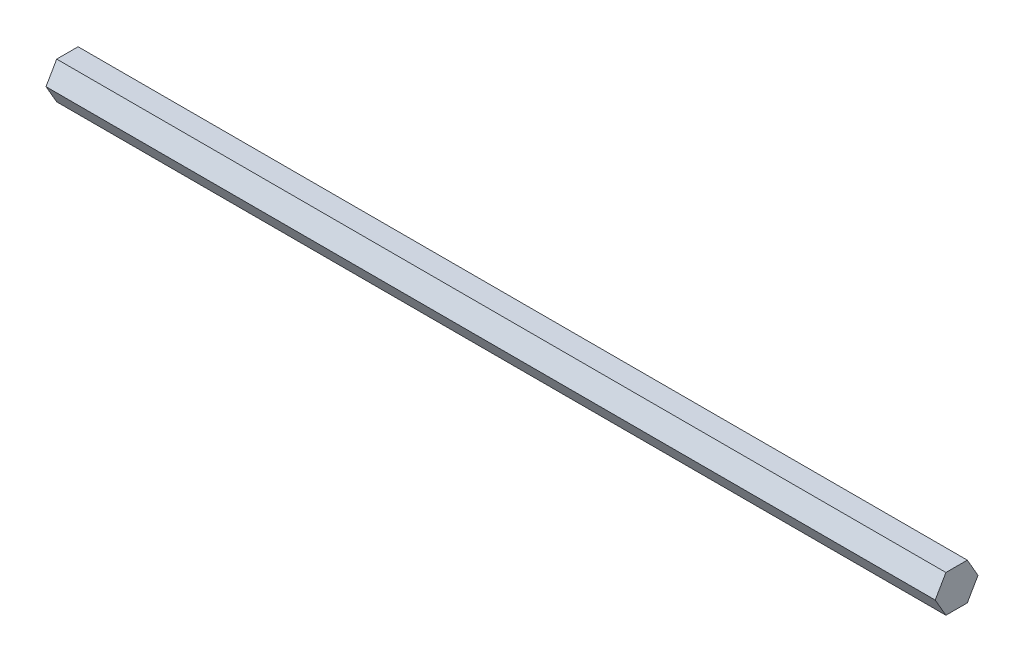
ISO-10303-21;
HEADER;
FILE_DESCRIPTION(('STEP AP214'),'2;1');
FILE_NAME('part.step','',(''),(''),'','','');
FILE_SCHEMA(('AUTOMOTIVE_DESIGN { 1 0 10303 214 1 1 1 1 }'));
ENDSEC;
DATA;
#1=APPLICATION_CONTEXT('core data for automotive mechanical design processes');
#2=APPLICATION_PROTOCOL_DEFINITION('international standard','automotive_design',2000,#1);
#3=PRODUCT_CONTEXT('',#1,'mechanical');
#4=PRODUCT('Part','Part','',(#3));
#5=PRODUCT_RELATED_PRODUCT_CATEGORY('part','',(#4));
#6=PRODUCT_DEFINITION_FORMATION('','',#4);
#7=PRODUCT_DEFINITION_CONTEXT('part definition',#1,'design');
#8=PRODUCT_DEFINITION('design','',#6,#7);
#9=PRODUCT_DEFINITION_SHAPE('','',#8);
#10=(LENGTH_UNIT() NAMED_UNIT(*) SI_UNIT(.MILLI.,.METRE.));
#11=(NAMED_UNIT(*) PLANE_ANGLE_UNIT() SI_UNIT($,.RADIAN.));
#12=(NAMED_UNIT(*) SI_UNIT($,.STERADIAN.) SOLID_ANGLE_UNIT());
#13=UNCERTAINTY_MEASURE_WITH_UNIT(LENGTH_MEASURE(1.E-05),#10,'distance_accuracy_value','');
#14=(GEOMETRIC_REPRESENTATION_CONTEXT(3) GLOBAL_UNCERTAINTY_ASSIGNED_CONTEXT((#13)) GLOBAL_UNIT_ASSIGNED_CONTEXT((#10,
#11,#12)) REPRESENTATION_CONTEXT('',''));
#15=CARTESIAN_POINT('',(0.,0.,0.));
#16=DIRECTION('',(0.,0.,1.));
#17=DIRECTION('',(1.,0.,0.));
#18=AXIS2_PLACEMENT_3D('',#15,#16,#17);
#19=CARTESIAN_POINT('',(0.,0.,0.));
#20=DIRECTION('',(1.,0.,0.));
#21=DIRECTION('',(0.,1.,0.));
#22=AXIS2_PLACEMENT_3D('',#19,#20,#21);
#23=PLANE('',#22);
#24=DIRECTION('',(0.,0.,1.));
#25=VECTOR('',#24,1.);
#26=CARTESIAN_POINT('',(0.,6.35,-3.66617420935413));
#27=LINE('',#26,#25);
#28=CARTESIAN_POINT('',(0.,6.35,-3.66617420935413));
#29=VERTEX_POINT('',#28);
#30=CARTESIAN_POINT('',(0.,6.35,3.66617420935412));
#31=VERTEX_POINT('',#30);
#32=EDGE_CURVE('E184',#29,#31,#27,.T.);
#33=ORIENTED_EDGE('',*,*,#32,.F.);
#34=DIRECTION('',(0.,0.866025403784439,0.5));
#35=VECTOR('',#34,1.);
#36=CARTESIAN_POINT('',(0.,0.,-7.33234841870825));
#37=LINE('',#36,#35);
#38=CARTESIAN_POINT('',(0.,0.,-7.33234841870825));
#39=VERTEX_POINT('',#38);
#40=EDGE_CURVE('E27',#39,#29,#37,.T.);
#41=ORIENTED_EDGE('',*,*,#40,.F.);
#42=DIRECTION('',(0.,0.866025403784439,-0.5));
#43=VECTOR('',#42,1.);
#44=CARTESIAN_POINT('',(0.,-6.35,-3.66617420935413));
#45=LINE('',#44,#43);
#46=CARTESIAN_POINT('',(0.,-6.35,-3.66617420935413));
#47=VERTEX_POINT('',#46);
#48=EDGE_CURVE('E92',#47,#39,#45,.T.);
#49=ORIENTED_EDGE('',*,*,#48,.F.);
#50=DIRECTION('',(0.,0.,-1.));
#51=VECTOR('',#50,1.);
#52=CARTESIAN_POINT('',(0.,-6.35,3.66617420935412));
#53=LINE('',#52,#51);
#54=CARTESIAN_POINT('',(0.,-6.35,3.66617420935412));
#55=VERTEX_POINT('',#54);
#56=EDGE_CURVE('E98',#55,#47,#53,.T.);
#57=ORIENTED_EDGE('',*,*,#56,.F.);
#58=DIRECTION('',(0.,-0.866025403784439,-0.5));
#59=VECTOR('',#58,1.);
#60=CARTESIAN_POINT('',(0.,0.,7.33234841870825));
#61=LINE('',#60,#59);
#62=CARTESIAN_POINT('',(0.,0.,7.33234841870825));
#63=VERTEX_POINT('',#62);
#64=EDGE_CURVE('E117',#63,#55,#61,.T.);
#65=ORIENTED_EDGE('',*,*,#64,.F.);
#66=DIRECTION('',(0.,-0.866025403784438,0.5));
#67=VECTOR('',#66,1.);
#68=CARTESIAN_POINT('',(0.,6.35,3.66617420935412));
#69=LINE('',#68,#67);
#70=EDGE_CURVE('E152',#31,#63,#69,.T.);
#71=ORIENTED_EDGE('',*,*,#70,.F.);
#72=EDGE_LOOP('',(#33,#41,#49,#57,#65,#71));
#73=FACE_BOUND('',#72,.T.);
#74=ADVANCED_FACE('F17',(#73),#23,.F.);
#75=CARTESIAN_POINT('',(304.8,0.,0.));
#76=DIRECTION('',(1.,0.,0.));
#77=DIRECTION('',(0.,1.,0.));
#78=AXIS2_PLACEMENT_3D('',#75,#76,#77);
#79=PLANE('',#78);
#80=DIRECTION('',(0.,0.,1.));
#81=VECTOR('',#80,1.);
#82=CARTESIAN_POINT('',(304.8,6.35,-3.66617420935413));
#83=LINE('',#82,#81);
#84=CARTESIAN_POINT('',(304.8,6.35,-3.66617420935413));
#85=VERTEX_POINT('',#84);
#86=CARTESIAN_POINT('',(304.8,6.35,3.66617420935412));
#87=VERTEX_POINT('',#86);
#88=EDGE_CURVE('E166',#85,#87,#83,.T.);
#89=ORIENTED_EDGE('',*,*,#88,.T.);
#90=DIRECTION('',(0.,-0.866025403784438,0.5));
#91=VECTOR('',#90,1.);
#92=CARTESIAN_POINT('',(304.8,6.35,3.66617420935412));
#93=LINE('',#92,#91);
#94=CARTESIAN_POINT('',(304.8,0.,7.33234841870825));
#95=VERTEX_POINT('',#94);
#96=EDGE_CURVE('E140',#87,#95,#93,.T.);
#97=ORIENTED_EDGE('',*,*,#96,.T.);
#98=DIRECTION('',(0.,-0.866025403784439,-0.5));
#99=VECTOR('',#98,1.);
#100=CARTESIAN_POINT('',(304.8,0.,7.33234841870825));
#101=LINE('',#100,#99);
#102=CARTESIAN_POINT('',(304.8,-6.35,3.66617420935412));
#103=VERTEX_POINT('',#102);
#104=EDGE_CURVE('E89',#95,#103,#101,.T.);
#105=ORIENTED_EDGE('',*,*,#104,.T.);
#106=DIRECTION('',(0.,0.,-1.));
#107=VECTOR('',#106,1.);
#108=CARTESIAN_POINT('',(304.8,-6.35,3.66617420935412));
#109=LINE('',#108,#107);
#110=CARTESIAN_POINT('',(304.8,-6.35,-3.66617420935413));
#111=VERTEX_POINT('',#110);
#112=EDGE_CURVE('E88',#103,#111,#109,.T.);
#113=ORIENTED_EDGE('',*,*,#112,.T.);
#114=DIRECTION('',(0.,0.866025403784439,-0.5));
#115=VECTOR('',#114,1.);
#116=CARTESIAN_POINT('',(304.8,-6.35,-3.66617420935413));
#117=LINE('',#116,#115);
#118=CARTESIAN_POINT('',(304.8,0.,-7.33234841870825));
#119=VERTEX_POINT('',#118);
#120=EDGE_CURVE('E72',#111,#119,#117,.T.);
#121=ORIENTED_EDGE('',*,*,#120,.T.);
#122=DIRECTION('',(0.,0.866025403784439,0.5));
#123=VECTOR('',#122,1.);
#124=CARTESIAN_POINT('',(304.8,0.,-7.33234841870825));
#125=LINE('',#124,#123);
#126=EDGE_CURVE('E11',#119,#85,#125,.T.);
#127=ORIENTED_EDGE('',*,*,#126,.T.);
#128=EDGE_LOOP('',(#89,#97,#105,#113,#121,#127));
#129=FACE_BOUND('',#128,.T.);
#130=ADVANCED_FACE('F86',(#129),#79,.T.);
#131=CARTESIAN_POINT('',(304.8,0.,-7.33234841870825));
#132=DIRECTION('',(0.,-0.5,0.866025403784439));
#133=DIRECTION('',(-1.,0.,0.));
#134=AXIS2_PLACEMENT_3D('',#131,#132,#133);
#135=PLANE('',#134);
#136=ORIENTED_EDGE('',*,*,#40,.T.);
#137=DIRECTION('',(-1.,0.,0.));
#138=VECTOR('',#137,1.);
#139=CARTESIAN_POINT('',(304.8,6.35,-3.66617420935413));
#140=LINE('',#139,#138);
#141=EDGE_CURVE('E165',#85,#29,#140,.T.);
#142=ORIENTED_EDGE('',*,*,#141,.F.);
#143=ORIENTED_EDGE('',*,*,#126,.F.);
#144=DIRECTION('',(-1.,0.,0.));
#145=VECTOR('',#144,1.);
#146=CARTESIAN_POINT('',(304.8,0.,-7.33234841870825));
#147=LINE('',#146,#145);
#148=EDGE_CURVE('E81',#119,#39,#147,.T.);
#149=ORIENTED_EDGE('',*,*,#148,.T.);
#150=EDGE_LOOP('',(#136,#142,#143,#149));
#151=FACE_BOUND('',#150,.T.);
#152=ADVANCED_FACE('F245',(#151),#135,.F.);
#153=CARTESIAN_POINT('',(304.8,-6.35,-3.66617420935413));
#154=DIRECTION('',(0.,0.5,0.866025403784439));
#155=DIRECTION('',(1.,0.,0.));
#156=AXIS2_PLACEMENT_3D('',#153,#154,#155);
#157=PLANE('',#156);
#158=ORIENTED_EDGE('',*,*,#48,.T.);
#159=ORIENTED_EDGE('',*,*,#148,.F.);
#160=ORIENTED_EDGE('',*,*,#120,.F.);
#161=DIRECTION('',(-1.,0.,0.));
#162=VECTOR('',#161,1.);
#163=CARTESIAN_POINT('',(304.8,-6.35,-3.66617420935413));
#164=LINE('',#163,#162);
#165=EDGE_CURVE('E78',#111,#47,#164,.T.);
#166=ORIENTED_EDGE('',*,*,#165,.T.);
#167=EDGE_LOOP('',(#158,#159,#160,#166));
#168=FACE_BOUND('',#167,.T.);
#169=ADVANCED_FACE('F80',(#168),#157,.F.);
#170=CARTESIAN_POINT('',(304.8,-6.35,3.66617420935412));
#171=DIRECTION('',(0.,1.,0.));
#172=DIRECTION('',(1.,0.,0.));
#173=AXIS2_PLACEMENT_3D('',#170,#171,#172);
#174=PLANE('',#173);
#175=ORIENTED_EDGE('',*,*,#56,.T.);
#176=ORIENTED_EDGE('',*,*,#165,.F.);
#177=ORIENTED_EDGE('',*,*,#112,.F.);
#178=DIRECTION('',(-1.,0.,0.));
#179=VECTOR('',#178,1.);
#180=CARTESIAN_POINT('',(304.8,-6.35,3.66617420935412));
#181=LINE('',#180,#179);
#182=EDGE_CURVE('E119',#103,#55,#181,.T.);
#183=ORIENTED_EDGE('',*,*,#182,.T.);
#184=EDGE_LOOP('',(#175,#176,#177,#183));
#185=FACE_BOUND('',#184,.T.);
#186=ADVANCED_FACE('F100',(#185),#174,.F.);
#187=CARTESIAN_POINT('',(304.8,0.,7.33234841870825));
#188=DIRECTION('',(0.,0.5,-0.866025403784439));
#189=DIRECTION('',(-1.,0.,0.));
#190=AXIS2_PLACEMENT_3D('',#187,#188,#189);
#191=PLANE('',#190);
#192=ORIENTED_EDGE('',*,*,#64,.T.);
#193=ORIENTED_EDGE('',*,*,#182,.F.);
#194=ORIENTED_EDGE('',*,*,#104,.F.);
#195=DIRECTION('',(-1.,0.,0.));
#196=VECTOR('',#195,1.);
#197=CARTESIAN_POINT('',(304.8,0.,7.33234841870825));
#198=LINE('',#197,#196);
#199=EDGE_CURVE('E145',#95,#63,#198,.T.);
#200=ORIENTED_EDGE('',*,*,#199,.T.);
#201=EDGE_LOOP('',(#192,#193,#194,#200));
#202=FACE_BOUND('',#201,.T.);
#203=ADVANCED_FACE('F257',(#202),#191,.F.);
#204=CARTESIAN_POINT('',(304.8,6.35,3.66617420935412));
#205=DIRECTION('',(0.,-0.5,-0.866025403784438));
#206=DIRECTION('',(0.,-0.866025403784438,0.5));
#207=AXIS2_PLACEMENT_3D('',#204,#205,#206);
#208=PLANE('',#207);
#209=ORIENTED_EDGE('',*,*,#70,.T.);
#210=ORIENTED_EDGE('',*,*,#199,.F.);
#211=ORIENTED_EDGE('',*,*,#96,.F.);
#212=DIRECTION('',(-1.,0.,0.));
#213=VECTOR('',#212,1.);
#214=CARTESIAN_POINT('',(304.8,6.35,3.66617420935412));
#215=LINE('',#214,#213);
#216=EDGE_CURVE('E176',#87,#31,#215,.T.);
#217=ORIENTED_EDGE('',*,*,#216,.T.);
#218=EDGE_LOOP('',(#209,#210,#211,#217));
#219=FACE_BOUND('',#218,.T.);
#220=ADVANCED_FACE('F253',(#219),#208,.F.);
#221=CARTESIAN_POINT('',(304.8,6.35,-3.66617420935413));
#222=DIRECTION('',(0.,-1.,0.));
#223=DIRECTION('',(0.,0.,-1.));
#224=AXIS2_PLACEMENT_3D('',#221,#222,#223);
#225=PLANE('',#224);
#226=ORIENTED_EDGE('',*,*,#32,.T.);
#227=ORIENTED_EDGE('',*,*,#216,.F.);
#228=ORIENTED_EDGE('',*,*,#88,.F.);
#229=ORIENTED_EDGE('',*,*,#141,.T.);
#230=EDGE_LOOP('',(#226,#227,#228,#229));
#231=FACE_BOUND('',#230,.T.);
#232=ADVANCED_FACE('F250',(#231),#225,.F.);
#233=CLOSED_SHELL('',(#74,#130,#152,#169,#186,#203,#220,#232));
#234=MANIFOLD_SOLID_BREP('B1',#233);
#235=ADVANCED_BREP_SHAPE_REPRESENTATION('',(#18,#234),#14);
#236=SHAPE_DEFINITION_REPRESENTATION(#9,#235);
ENDSEC;
END-ISO-10303-21;
